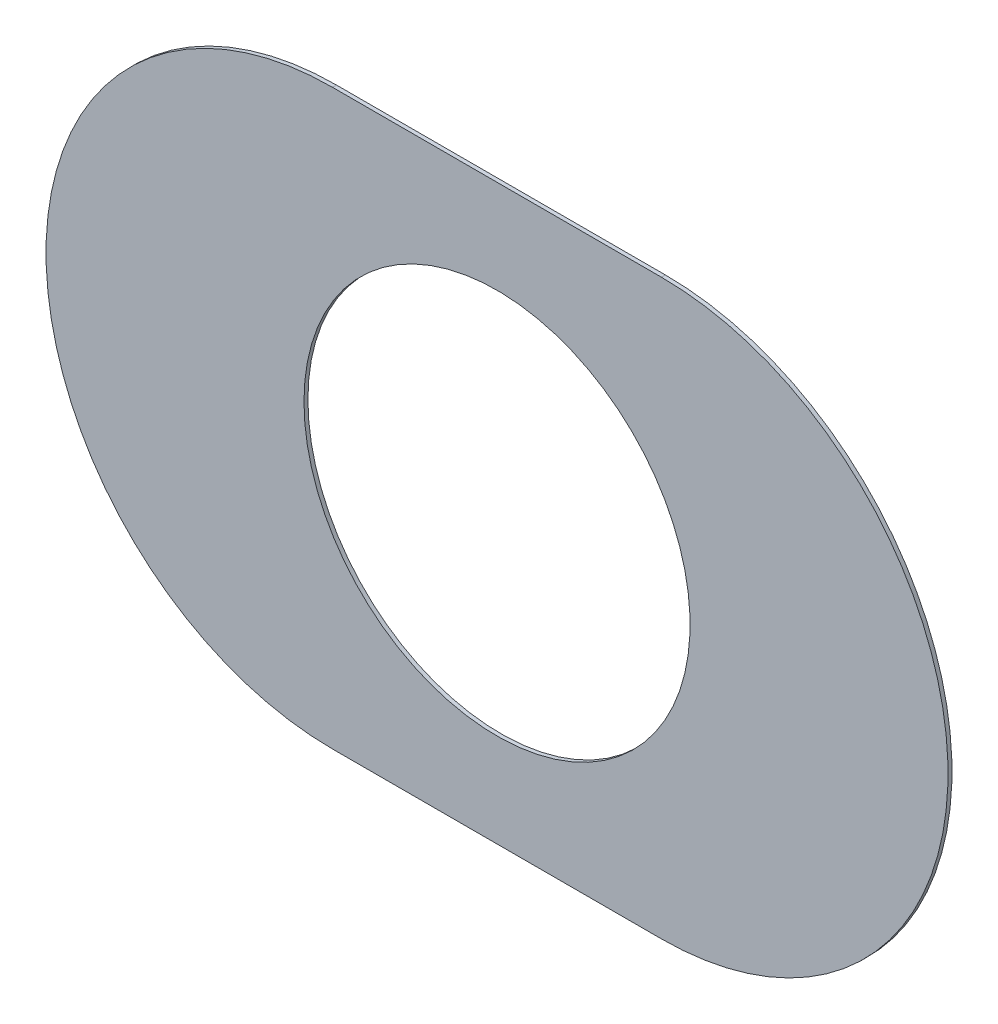
ISO-10303-21;
HEADER;
FILE_DESCRIPTION(('STEP AP214'),'2;1');
FILE_NAME('part.step','',(''),(''),'','','');
FILE_SCHEMA(('AUTOMOTIVE_DESIGN { 1 0 10303 214 1 1 1 1 }'));
ENDSEC;
DATA;
#1=APPLICATION_CONTEXT('core data for automotive mechanical design processes');
#2=APPLICATION_PROTOCOL_DEFINITION('international standard','automotive_design',2000,#1);
#3=PRODUCT_CONTEXT('',#1,'mechanical');
#4=PRODUCT('Part','Part','',(#3));
#5=PRODUCT_RELATED_PRODUCT_CATEGORY('part','',(#4));
#6=PRODUCT_DEFINITION_FORMATION('','',#4);
#7=PRODUCT_DEFINITION_CONTEXT('part definition',#1,'design');
#8=PRODUCT_DEFINITION('design','',#6,#7);
#9=PRODUCT_DEFINITION_SHAPE('','',#8);
#10=(LENGTH_UNIT() NAMED_UNIT(*) SI_UNIT(.MILLI.,.METRE.));
#11=(NAMED_UNIT(*) PLANE_ANGLE_UNIT() SI_UNIT($,.RADIAN.));
#12=(NAMED_UNIT(*) SI_UNIT($,.STERADIAN.) SOLID_ANGLE_UNIT());
#13=UNCERTAINTY_MEASURE_WITH_UNIT(LENGTH_MEASURE(1.E-05),#10,'distance_accuracy_value','');
#14=(GEOMETRIC_REPRESENTATION_CONTEXT(3) GLOBAL_UNCERTAINTY_ASSIGNED_CONTEXT((#13)) GLOBAL_UNIT_ASSIGNED_CONTEXT((#10,
#11,#12)) REPRESENTATION_CONTEXT('',''));
#15=CARTESIAN_POINT('',(0.,0.,0.));
#16=DIRECTION('',(0.,0.,1.));
#17=DIRECTION('',(1.,0.,0.));
#18=AXIS2_PLACEMENT_3D('',#15,#16,#17);
#19=CARTESIAN_POINT('',(1.54999965727325,37.4000006854535,0.));
#20=DIRECTION('',(0.,0.,-1.));
#21=DIRECTION('',(0.,-1.,0.));
#22=AXIS2_PLACEMENT_3D('',#19,#20,#21);
#23=PLANE('',#22);
#24=CARTESIAN_POINT('',(1.54999965727325,37.4000006854535,0.));
#25=DIRECTION('',(0.,0.,1.));
#26=DIRECTION('',(1.,0.,0.));
#27=AXIS2_PLACEMENT_3D('',#24,#25,#26);
#28=CIRCLE('',#27,0.49);
#29=CARTESIAN_POINT('',(1.05999965727325,37.4000006854535,0.));
#30=VERTEX_POINT('',#29);
#31=EDGE_CURVE('E62',#30,#30,#28,.T.);
#32=ORIENTED_EDGE('',*,*,#31,.F.);
#33=EDGE_LOOP('',(#32));
#34=FACE_BOUND('',#33,.T.);
#35=CARTESIAN_POINT('',(1.96740611181985,37.4000006854535,0.));
#36=DIRECTION('',(0.,0.,-1.));
#37=DIRECTION('',(0.,1.,0.));
#38=AXIS2_PLACEMENT_3D('',#35,#36,#37);
#39=CIRCLE('',#38,0.727257121659981);
#40=CARTESIAN_POINT('',(1.96740611181985,38.1272578071135,0.));
#41=VERTEX_POINT('',#40);
#42=CARTESIAN_POINT('',(1.96740611181985,36.6727435637935,0.));
#43=VERTEX_POINT('',#42);
#44=EDGE_CURVE('E28',#41,#43,#39,.T.);
#45=ORIENTED_EDGE('',*,*,#44,.F.);
#46=DIRECTION('',(1.,0.,0.));
#47=VECTOR('',#46,1.);
#48=CARTESIAN_POINT('',(1.13259320272665,38.1272578071135,0.));
#49=LINE('',#48,#47);
#50=CARTESIAN_POINT('',(1.13259320272665,38.1272578071135,0.));
#51=VERTEX_POINT('',#50);
#52=EDGE_CURVE('E92',#51,#41,#49,.T.);
#53=ORIENTED_EDGE('',*,*,#52,.F.);
#54=CARTESIAN_POINT('',(1.13259320272665,37.4000006854535,0.));
#55=DIRECTION('',(0.,0.,-1.));
#56=DIRECTION('',(0.,-1.,0.));
#57=AXIS2_PLACEMENT_3D('',#54,#55,#56);
#58=CIRCLE('',#57,0.727257121659981);
#59=CARTESIAN_POINT('',(1.13259320272665,36.6727435637935,0.));
#60=VERTEX_POINT('',#59);
#61=EDGE_CURVE('E21',#60,#51,#58,.T.);
#62=ORIENTED_EDGE('',*,*,#61,.F.);
#63=DIRECTION('',(-1.,0.,0.));
#64=VECTOR('',#63,1.);
#65=CARTESIAN_POINT('',(1.96740611181985,36.6727435637935,0.));
#66=LINE('',#65,#64);
#67=EDGE_CURVE('E82',#43,#60,#66,.T.);
#68=ORIENTED_EDGE('',*,*,#67,.F.);
#69=EDGE_LOOP('',(#45,#53,#62,#68));
#70=FACE_BOUND('',#69,.T.);
#71=ADVANCED_FACE('F17',(#34,#70),#23,.F.);
#72=CARTESIAN_POINT('',(1.54999965727325,37.4000006854535,-0.01));
#73=DIRECTION('',(0.,0.,-1.));
#74=DIRECTION('',(0.,-1.,0.));
#75=AXIS2_PLACEMENT_3D('',#72,#73,#74);
#76=PLANE('',#75);
#77=CARTESIAN_POINT('',(1.54999965727325,37.4000006854535,-0.01));
#78=DIRECTION('',(0.,0.,1.));
#79=DIRECTION('',(1.,0.,0.));
#80=AXIS2_PLACEMENT_3D('',#77,#78,#79);
#81=CIRCLE('',#80,0.49);
#82=CARTESIAN_POINT('',(1.05999965727325,37.4000006854535,-0.01));
#83=VERTEX_POINT('',#82);
#84=EDGE_CURVE('E72',#83,#83,#81,.T.);
#85=ORIENTED_EDGE('',*,*,#84,.T.);
#86=EDGE_LOOP('',(#85));
#87=FACE_BOUND('',#86,.T.);
#88=CARTESIAN_POINT('',(1.96740611181985,37.4000006854535,-0.01));
#89=DIRECTION('',(0.,0.,-1.));
#90=DIRECTION('',(0.,1.,0.));
#91=AXIS2_PLACEMENT_3D('',#88,#89,#90);
#92=CIRCLE('',#91,0.727257121659981);
#93=CARTESIAN_POINT('',(1.96740611181985,38.1272578071135,-0.01));
#94=VERTEX_POINT('',#93);
#95=CARTESIAN_POINT('',(1.96740611181985,36.6727435637935,-0.01));
#96=VERTEX_POINT('',#95);
#97=EDGE_CURVE('E11',#94,#96,#92,.T.);
#98=ORIENTED_EDGE('',*,*,#97,.T.);
#99=DIRECTION('',(-1.,0.,0.));
#100=VECTOR('',#99,1.);
#101=CARTESIAN_POINT('',(1.96740611181985,36.6727435637935,-0.01));
#102=LINE('',#101,#100);
#103=CARTESIAN_POINT('',(1.13259320272665,36.6727435637935,-0.01));
#104=VERTEX_POINT('',#103);
#105=EDGE_CURVE('E85',#96,#104,#102,.T.);
#106=ORIENTED_EDGE('',*,*,#105,.T.);
#107=CARTESIAN_POINT('',(1.13259320272665,37.4000006854535,-0.01));
#108=DIRECTION('',(0.,0.,-1.));
#109=DIRECTION('',(0.,-1.,0.));
#110=AXIS2_PLACEMENT_3D('',#107,#108,#109);
#111=CIRCLE('',#110,0.727257121659981);
#112=CARTESIAN_POINT('',(1.13259320272665,38.1272578071135,-0.01));
#113=VERTEX_POINT('',#112);
#114=EDGE_CURVE('E99',#104,#113,#111,.T.);
#115=ORIENTED_EDGE('',*,*,#114,.T.);
#116=DIRECTION('',(1.,0.,0.));
#117=VECTOR('',#116,1.);
#118=CARTESIAN_POINT('',(1.13259320272665,38.1272578071135,-0.01));
#119=LINE('',#118,#117);
#120=EDGE_CURVE('E91',#113,#94,#119,.T.);
#121=ORIENTED_EDGE('',*,*,#120,.T.);
#122=EDGE_LOOP('',(#98,#106,#115,#121));
#123=FACE_BOUND('',#122,.T.);
#124=ADVANCED_FACE('F76',(#87,#123),#76,.T.);
#125=CARTESIAN_POINT('',(1.96740611181985,37.4000006854535,0.));
#126=DIRECTION('',(0.,0.,-1.));
#127=DIRECTION('',(0.,1.,0.));
#128=AXIS2_PLACEMENT_3D('',#125,#126,#127);
#129=CYLINDRICAL_SURFACE('',#128,0.727257121659981);
#130=ORIENTED_EDGE('',*,*,#44,.T.);
#131=DIRECTION('',(0.,0.,-1.));
#132=VECTOR('',#131,1.);
#133=CARTESIAN_POINT('',(1.96740611181985,36.6727435637935,0.));
#134=LINE('',#133,#132);
#135=EDGE_CURVE('E95',#43,#96,#134,.T.);
#136=ORIENTED_EDGE('',*,*,#135,.T.);
#137=ORIENTED_EDGE('',*,*,#97,.F.);
#138=DIRECTION('',(0.,0.,-1.));
#139=VECTOR('',#138,1.);
#140=CARTESIAN_POINT('',(1.96740611181985,38.1272578071135,0.));
#141=LINE('',#140,#139);
#142=EDGE_CURVE('E87',#41,#94,#141,.T.);
#143=ORIENTED_EDGE('',*,*,#142,.F.);
#144=EDGE_LOOP('',(#130,#136,#137,#143));
#145=FACE_BOUND('',#144,.T.);
#146=ADVANCED_FACE('F136',(#145),#129,.T.);
#147=CARTESIAN_POINT('',(1.96740611181985,36.6727435637935,0.));
#148=DIRECTION('',(0.,-1.,0.));
#149=DIRECTION('',(0.,0.,-1.));
#150=AXIS2_PLACEMENT_3D('',#147,#148,#149);
#151=PLANE('',#150);
#152=ORIENTED_EDGE('',*,*,#67,.T.);
#153=DIRECTION('',(0.,0.,-1.));
#154=VECTOR('',#153,1.);
#155=CARTESIAN_POINT('',(1.13259320272665,36.6727435637935,0.));
#156=LINE('',#155,#154);
#157=EDGE_CURVE('E86',#60,#104,#156,.T.);
#158=ORIENTED_EDGE('',*,*,#157,.T.);
#159=ORIENTED_EDGE('',*,*,#105,.F.);
#160=ORIENTED_EDGE('',*,*,#135,.F.);
#161=EDGE_LOOP('',(#152,#158,#159,#160));
#162=FACE_BOUND('',#161,.T.);
#163=ADVANCED_FACE('F19',(#162),#151,.T.);
#164=CARTESIAN_POINT('',(1.13259320272665,37.4000006854535,0.));
#165=DIRECTION('',(0.,0.,-1.));
#166=DIRECTION('',(0.,-1.,0.));
#167=AXIS2_PLACEMENT_3D('',#164,#165,#166);
#168=CYLINDRICAL_SURFACE('',#167,0.727257121659981);
#169=ORIENTED_EDGE('',*,*,#61,.T.);
#170=DIRECTION('',(0.,0.,-1.));
#171=VECTOR('',#170,1.);
#172=CARTESIAN_POINT('',(1.13259320272665,38.1272578071135,0.));
#173=LINE('',#172,#171);
#174=EDGE_CURVE('E103',#51,#113,#173,.T.);
#175=ORIENTED_EDGE('',*,*,#174,.T.);
#176=ORIENTED_EDGE('',*,*,#114,.F.);
#177=ORIENTED_EDGE('',*,*,#157,.F.);
#178=EDGE_LOOP('',(#169,#175,#176,#177));
#179=FACE_BOUND('',#178,.T.);
#180=ADVANCED_FACE('F128',(#179),#168,.T.);
#181=CARTESIAN_POINT('',(1.13259320272665,38.1272578071135,0.));
#182=DIRECTION('',(0.,1.,0.));
#183=DIRECTION('',(1.,0.,0.));
#184=AXIS2_PLACEMENT_3D('',#181,#182,#183);
#185=PLANE('',#184);
#186=ORIENTED_EDGE('',*,*,#52,.T.);
#187=ORIENTED_EDGE('',*,*,#142,.T.);
#188=ORIENTED_EDGE('',*,*,#120,.F.);
#189=ORIENTED_EDGE('',*,*,#174,.F.);
#190=EDGE_LOOP('',(#186,#187,#188,#189));
#191=FACE_BOUND('',#190,.T.);
#192=ADVANCED_FACE('F133',(#191),#185,.T.);
#193=CARTESIAN_POINT('',(1.54999965727325,37.4000006854535,0.));
#194=DIRECTION('',(0.,0.,-1.));
#195=DIRECTION('',(1.,0.,0.));
#196=AXIS2_PLACEMENT_3D('',#193,#194,#195);
#197=CYLINDRICAL_SURFACE('',#196,0.49);
#198=ORIENTED_EDGE('',*,*,#84,.F.);
#199=DIRECTION('',(0.,0.,1.));
#200=VECTOR('',#199,1.);
#201=CARTESIAN_POINT('',(1.05999965727325,37.4000006854535,0.));
#202=LINE('',#201,#200);
#203=EDGE_CURVE('E69',#83,#30,#202,.T.);
#204=ORIENTED_EDGE('',*,*,#203,.T.);
#205=ORIENTED_EDGE('',*,*,#31,.T.);
#206=ORIENTED_EDGE('',*,*,#203,.F.);
#207=EDGE_LOOP('',(#198,#204,#205,#206));
#208=FACE_BOUND('',#207,.T.);
#209=ADVANCED_FACE('F71',(#208),#197,.F.);
#210=CLOSED_SHELL('',(#71,#124,#146,#163,#180,#192,#209));
#211=MANIFOLD_SOLID_BREP('B1',#210);
#212=ADVANCED_BREP_SHAPE_REPRESENTATION('',(#18,#211),#14);
#213=SHAPE_DEFINITION_REPRESENTATION(#9,#212);
ENDSEC;
END-ISO-10303-21;
